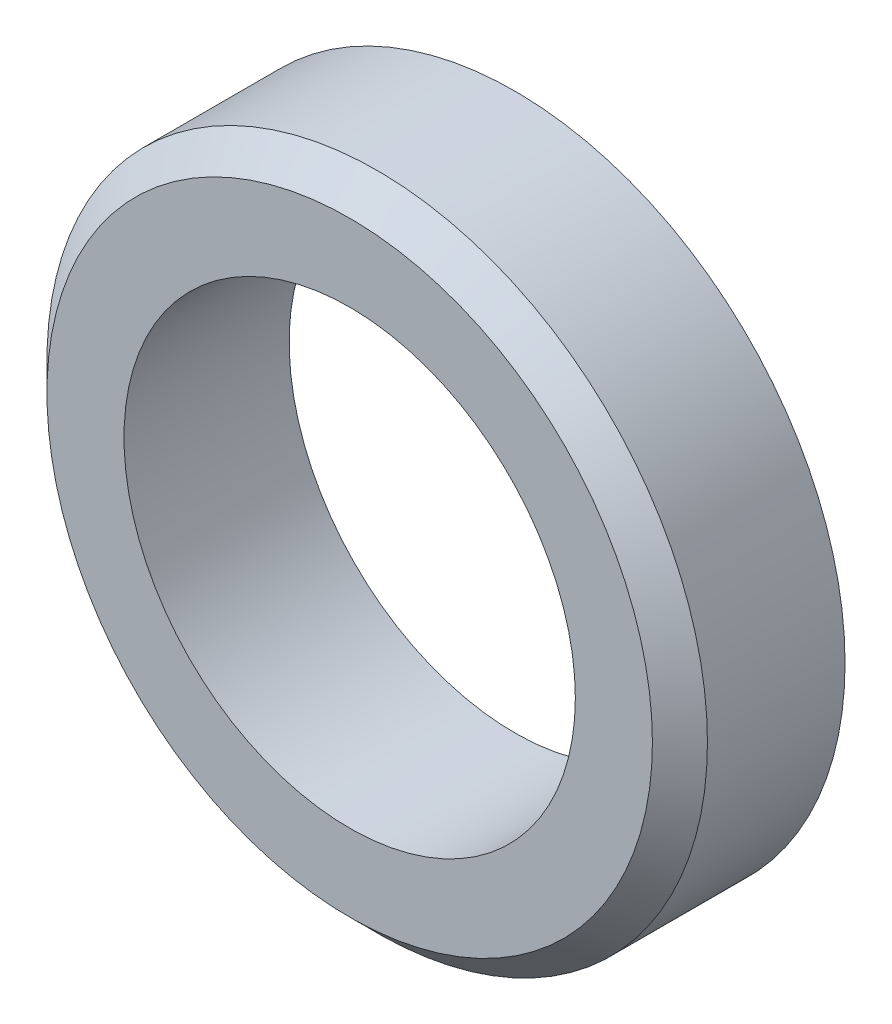
ISO-10303-21;
HEADER;
FILE_DESCRIPTION(('STEP AP214'),'2;1');
FILE_NAME('part.step','',(''),(''),'','','');
FILE_SCHEMA(('AUTOMOTIVE_DESIGN { 1 0 10303 214 1 1 1 1 }'));
ENDSEC;
DATA;
#1=APPLICATION_CONTEXT('core data for automotive mechanical design processes');
#2=APPLICATION_PROTOCOL_DEFINITION('international standard','automotive_design',2000,#1);
#3=PRODUCT_CONTEXT('',#1,'mechanical');
#4=PRODUCT('Part','Part','',(#3));
#5=PRODUCT_RELATED_PRODUCT_CATEGORY('part','',(#4));
#6=PRODUCT_DEFINITION_FORMATION('','',#4);
#7=PRODUCT_DEFINITION_CONTEXT('part definition',#1,'design');
#8=PRODUCT_DEFINITION('design','',#6,#7);
#9=PRODUCT_DEFINITION_SHAPE('','',#8);
#10=(LENGTH_UNIT() NAMED_UNIT(*) SI_UNIT(.MILLI.,.METRE.));
#11=(NAMED_UNIT(*) PLANE_ANGLE_UNIT() SI_UNIT($,.RADIAN.));
#12=(NAMED_UNIT(*) SI_UNIT($,.STERADIAN.) SOLID_ANGLE_UNIT());
#13=UNCERTAINTY_MEASURE_WITH_UNIT(LENGTH_MEASURE(1.E-05),#10,'distance_accuracy_value','');
#14=(GEOMETRIC_REPRESENTATION_CONTEXT(3) GLOBAL_UNCERTAINTY_ASSIGNED_CONTEXT((#13)) GLOBAL_UNIT_ASSIGNED_CONTEXT((#10,
#11,#12)) REPRESENTATION_CONTEXT('',''));
#15=CARTESIAN_POINT('',(0.,0.,0.));
#16=DIRECTION('',(0.,0.,1.));
#17=DIRECTION('',(1.,0.,0.));
#18=AXIS2_PLACEMENT_3D('',#15,#16,#17);
#19=CARTESIAN_POINT('',(0.,0.,3.));
#20=DIRECTION('',(0.,0.,-1.));
#21=DIRECTION('',(-1.,0.,0.));
#22=AXIS2_PLACEMENT_3D('',#19,#20,#21);
#23=CYLINDRICAL_SURFACE('',#22,6.);
#24=CARTESIAN_POINT('',(0.,0.,2.5));
#25=DIRECTION('',(0.,0.,1.));
#26=DIRECTION('',(1.,0.,0.));
#27=AXIS2_PLACEMENT_3D('',#24,#25,#26);
#28=CIRCLE('',#27,6.);
#29=CARTESIAN_POINT('',(6.,0.,2.5));
#30=VERTEX_POINT('',#29);
#31=EDGE_CURVE('E10',#30,#30,#28,.F.);
#32=ORIENTED_EDGE('',*,*,#31,.T.);
#33=EDGE_LOOP('',(#32));
#34=FACE_BOUND('',#33,.T.);
#35=CARTESIAN_POINT('',(0.,0.,0.));
#36=DIRECTION('',(0.,0.,1.));
#37=DIRECTION('',(1.,0.,0.));
#38=AXIS2_PLACEMENT_3D('',#35,#36,#37);
#39=CIRCLE('',#38,6.);
#40=CARTESIAN_POINT('',(6.,0.,0.));
#41=VERTEX_POINT('',#40);
#42=EDGE_CURVE('E39',#41,#41,#39,.T.);
#43=ORIENTED_EDGE('',*,*,#42,.T.);
#44=EDGE_LOOP('',(#43));
#45=FACE_BOUND('',#44,.T.);
#46=ADVANCED_FACE('F28',(#34,#45),#23,.T.);
#47=CARTESIAN_POINT('',(0.,0.,3.));
#48=DIRECTION('',(0.,0.,1.));
#49=DIRECTION('',(1.,0.,0.));
#50=AXIS2_PLACEMENT_3D('',#47,#48,#49);
#51=PLANE('',#50);
#52=CARTESIAN_POINT('',(0.,0.,3.));
#53=DIRECTION('',(0.,0.,1.));
#54=DIRECTION('',(1.,0.,0.));
#55=AXIS2_PLACEMENT_3D('',#52,#53,#54);
#56=CIRCLE('',#55,5.5);
#57=CARTESIAN_POINT('',(5.5,0.,3.));
#58=VERTEX_POINT('',#57);
#59=EDGE_CURVE('E35',#58,#58,#56,.T.);
#60=ORIENTED_EDGE('',*,*,#59,.T.);
#61=EDGE_LOOP('',(#60));
#62=FACE_BOUND('',#61,.T.);
#63=CARTESIAN_POINT('',(0.,0.,3.));
#64=DIRECTION('',(0.,0.,1.));
#65=DIRECTION('',(1.,0.,0.));
#66=AXIS2_PLACEMENT_3D('',#63,#64,#65);
#67=CIRCLE('',#66,4.1);
#68=CARTESIAN_POINT('',(4.1,0.,3.));
#69=VERTEX_POINT('',#68);
#70=EDGE_CURVE('E46',#69,#69,#67,.T.);
#71=ORIENTED_EDGE('',*,*,#70,.F.);
#72=EDGE_LOOP('',(#71));
#73=FACE_BOUND('',#72,.T.);
#74=ADVANCED_FACE('F61',(#62,#73),#51,.T.);
#75=CARTESIAN_POINT('',(0.,0.,0.));
#76=DIRECTION('',(0.,0.,1.));
#77=DIRECTION('',(1.,0.,0.));
#78=AXIS2_PLACEMENT_3D('',#75,#76,#77);
#79=PLANE('',#78);
#80=CARTESIAN_POINT('',(0.,0.,0.));
#81=DIRECTION('',(0.,0.,1.));
#82=DIRECTION('',(1.,0.,0.));
#83=AXIS2_PLACEMENT_3D('',#80,#81,#82);
#84=CIRCLE('',#83,4.1);
#85=CARTESIAN_POINT('',(4.1,0.,0.));
#86=VERTEX_POINT('',#85);
#87=EDGE_CURVE('E43',#86,#86,#84,.T.);
#88=ORIENTED_EDGE('',*,*,#87,.T.);
#89=EDGE_LOOP('',(#88));
#90=FACE_BOUND('',#89,.T.);
#91=ORIENTED_EDGE('',*,*,#42,.F.);
#92=EDGE_LOOP('',(#91));
#93=FACE_BOUND('',#92,.T.);
#94=ADVANCED_FACE('F52',(#90,#93),#79,.F.);
#95=CARTESIAN_POINT('',(0.,0.,0.));
#96=DIRECTION('',(0.,0.,1.));
#97=DIRECTION('',(1.,0.,0.));
#98=AXIS2_PLACEMENT_3D('',#95,#96,#97);
#99=CYLINDRICAL_SURFACE('',#98,4.1);
#100=ORIENTED_EDGE('',*,*,#87,.F.);
#101=EDGE_LOOP('',(#100));
#102=FACE_BOUND('',#101,.T.);
#103=ORIENTED_EDGE('',*,*,#70,.T.);
#104=EDGE_LOOP('',(#103));
#105=FACE_BOUND('',#104,.T.);
#106=ADVANCED_FACE('F55',(#102,#105),#99,.F.);
#107=CARTESIAN_POINT('',(0.,0.,3.));
#108=DIRECTION('',(0.,0.,-1.));
#109=DIRECTION('',(-1.,0.,0.));
#110=AXIS2_PLACEMENT_3D('',#107,#108,#109);
#111=CONICAL_SURFACE('',#110,5.5,0.785398163397447);
#112=ORIENTED_EDGE('',*,*,#31,.F.);
#113=EDGE_LOOP('',(#112));
#114=FACE_BOUND('',#113,.T.);
#115=ORIENTED_EDGE('',*,*,#59,.F.);
#116=EDGE_LOOP('',(#115));
#117=FACE_BOUND('',#116,.T.);
#118=ADVANCED_FACE('F30',(#114,#117),#111,.T.);
#119=CLOSED_SHELL('',(#46,#74,#94,#106,#118));
#120=MANIFOLD_SOLID_BREP('B2',#119);
#121=ADVANCED_BREP_SHAPE_REPRESENTATION('',(#18,#120),#14);
#122=SHAPE_DEFINITION_REPRESENTATION(#9,#121);
ENDSEC;
END-ISO-10303-21;
